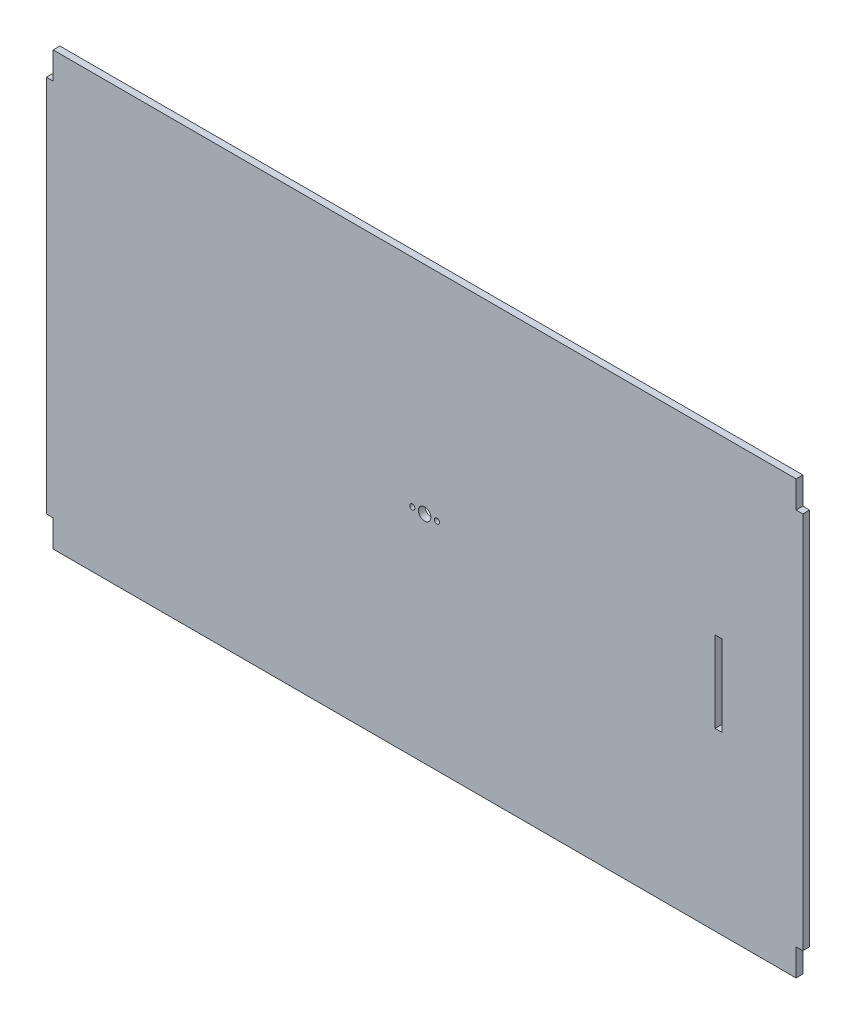
ISO-10303-21;
HEADER;
FILE_DESCRIPTION(('STEP AP214'),'2;1');
FILE_NAME('part.step','',(''),(''),'','','');
FILE_SCHEMA(('AUTOMOTIVE_DESIGN { 1 0 10303 214 1 1 1 1 }'));
ENDSEC;
DATA;
#1=APPLICATION_CONTEXT('core data for automotive mechanical design processes');
#2=APPLICATION_PROTOCOL_DEFINITION('international standard','automotive_design',2000,#1);
#3=PRODUCT_CONTEXT('',#1,'mechanical');
#4=PRODUCT('Part','Part','',(#3));
#5=PRODUCT_RELATED_PRODUCT_CATEGORY('part','',(#4));
#6=PRODUCT_DEFINITION_FORMATION('','',#4);
#7=PRODUCT_DEFINITION_CONTEXT('part definition',#1,'design');
#8=PRODUCT_DEFINITION('design','',#6,#7);
#9=PRODUCT_DEFINITION_SHAPE('','',#8);
#10=(LENGTH_UNIT() NAMED_UNIT(*) SI_UNIT(.MILLI.,.METRE.));
#11=(NAMED_UNIT(*) PLANE_ANGLE_UNIT() SI_UNIT($,.RADIAN.));
#12=(NAMED_UNIT(*) SI_UNIT($,.STERADIAN.) SOLID_ANGLE_UNIT());
#13=UNCERTAINTY_MEASURE_WITH_UNIT(LENGTH_MEASURE(1.E-05),#10,'distance_accuracy_value','');
#14=(GEOMETRIC_REPRESENTATION_CONTEXT(3) GLOBAL_UNCERTAINTY_ASSIGNED_CONTEXT((#13)) GLOBAL_UNIT_ASSIGNED_CONTEXT((#10,
#11,#12)) REPRESENTATION_CONTEXT('',''));
#15=CARTESIAN_POINT('',(0.,0.,0.));
#16=DIRECTION('',(0.,0.,1.));
#17=DIRECTION('',(1.,0.,0.));
#18=AXIS2_PLACEMENT_3D('',#15,#16,#17);
#19=CARTESIAN_POINT('',(3.175,203.2,3.175));
#20=DIRECTION('',(0.,-1.,0.));
#21=DIRECTION('',(0.,0.,-1.));
#22=AXIS2_PLACEMENT_3D('',#19,#20,#21);
#23=PLANE('',#22);
#24=DIRECTION('',(-1.,0.,0.));
#25=VECTOR('',#24,1.);
#26=CARTESIAN_POINT('',(3.175,203.2,0.));
#27=LINE('',#26,#25);
#28=CARTESIAN_POINT('',(352.425,203.2,0.));
#29=VERTEX_POINT('',#28);
#30=CARTESIAN_POINT('',(3.175,203.2,0.));
#31=VERTEX_POINT('',#30);
#32=EDGE_CURVE('E183',#29,#31,#27,.T.);
#33=ORIENTED_EDGE('',*,*,#32,.T.);
#34=DIRECTION('',(0.,0.,-1.));
#35=VECTOR('',#34,1.);
#36=CARTESIAN_POINT('',(3.175,203.2,3.175));
#37=LINE('',#36,#35);
#38=CARTESIAN_POINT('',(3.175,203.2,3.175));
#39=VERTEX_POINT('',#38);
#40=EDGE_CURVE('E11',#39,#31,#37,.T.);
#41=ORIENTED_EDGE('',*,*,#40,.F.);
#42=DIRECTION('',(-1.,0.,0.));
#43=VECTOR('',#42,1.);
#44=CARTESIAN_POINT('',(3.175,203.2,3.175));
#45=LINE('',#44,#43);
#46=CARTESIAN_POINT('',(352.425,203.2,3.175));
#47=VERTEX_POINT('',#46);
#48=EDGE_CURVE('E187',#47,#39,#45,.T.);
#49=ORIENTED_EDGE('',*,*,#48,.F.);
#50=DIRECTION('',(0.,0.,-1.));
#51=VECTOR('',#50,1.);
#52=CARTESIAN_POINT('',(352.425,203.2,3.175));
#53=LINE('',#52,#51);
#54=EDGE_CURVE('E213',#47,#29,#53,.T.);
#55=ORIENTED_EDGE('',*,*,#54,.T.);
#56=EDGE_LOOP('',(#33,#41,#49,#55));
#57=FACE_BOUND('',#56,.T.);
#58=ADVANCED_FACE('F34',(#57),#23,.F.);
#59=CARTESIAN_POINT('',(3.175,203.2,3.175));
#60=DIRECTION('',(1.,0.,0.));
#61=DIRECTION('',(0.,1.,0.));
#62=AXIS2_PLACEMENT_3D('',#59,#60,#61);
#63=PLANE('',#62);
#64=DIRECTION('',(0.,-1.,0.));
#65=VECTOR('',#64,1.);
#66=CARTESIAN_POINT('',(3.175,203.2,0.));
#67=LINE('',#66,#65);
#68=CARTESIAN_POINT('',(3.175,190.5,0.));
#69=VERTEX_POINT('',#68);
#70=EDGE_CURVE('E216',#31,#69,#67,.T.);
#71=ORIENTED_EDGE('',*,*,#70,.T.);
#72=DIRECTION('',(0.,0.,-1.));
#73=VECTOR('',#72,1.);
#74=CARTESIAN_POINT('',(3.175,190.5,3.175));
#75=LINE('',#74,#73);
#76=CARTESIAN_POINT('',(3.175,190.5,3.175));
#77=VERTEX_POINT('',#76);
#78=EDGE_CURVE('E41',#77,#69,#75,.T.);
#79=ORIENTED_EDGE('',*,*,#78,.F.);
#80=DIRECTION('',(0.,-1.,0.));
#81=VECTOR('',#80,1.);
#82=CARTESIAN_POINT('',(3.175,203.2,3.175));
#83=LINE('',#82,#81);
#84=EDGE_CURVE('E190',#39,#77,#83,.T.);
#85=ORIENTED_EDGE('',*,*,#84,.F.);
#86=ORIENTED_EDGE('',*,*,#40,.T.);
#87=EDGE_LOOP('',(#71,#79,#85,#86));
#88=FACE_BOUND('',#87,.T.);
#89=ADVANCED_FACE('F291',(#88),#63,.F.);
#90=CARTESIAN_POINT('',(3.175,190.5,3.175));
#91=DIRECTION('',(0.,-1.,0.));
#92=DIRECTION('',(0.,0.,-1.));
#93=AXIS2_PLACEMENT_3D('',#90,#91,#92);
#94=PLANE('',#93);
#95=DIRECTION('',(-1.,0.,0.));
#96=VECTOR('',#95,1.);
#97=CARTESIAN_POINT('',(3.175,190.5,0.));
#98=LINE('',#97,#96);
#99=CARTESIAN_POINT('',(0.,190.5,0.));
#100=VERTEX_POINT('',#99);
#101=EDGE_CURVE('E218',#69,#100,#98,.T.);
#102=ORIENTED_EDGE('',*,*,#101,.T.);
#103=DIRECTION('',(0.,0.,-1.));
#104=VECTOR('',#103,1.);
#105=CARTESIAN_POINT('',(0.,190.5,3.175));
#106=LINE('',#105,#104);
#107=CARTESIAN_POINT('',(0.,190.5,3.175));
#108=VERTEX_POINT('',#107);
#109=EDGE_CURVE('E263',#108,#100,#106,.T.);
#110=ORIENTED_EDGE('',*,*,#109,.F.);
#111=DIRECTION('',(-1.,0.,0.));
#112=VECTOR('',#111,1.);
#113=CARTESIAN_POINT('',(3.175,190.5,3.175));
#114=LINE('',#113,#112);
#115=EDGE_CURVE('E193',#77,#108,#114,.T.);
#116=ORIENTED_EDGE('',*,*,#115,.F.);
#117=ORIENTED_EDGE('',*,*,#78,.T.);
#118=EDGE_LOOP('',(#102,#110,#116,#117));
#119=FACE_BOUND('',#118,.T.);
#120=ADVANCED_FACE('F270',(#119),#94,.F.);
#121=CARTESIAN_POINT('',(0.,12.7,3.175));
#122=DIRECTION('',(1.,0.,0.));
#123=DIRECTION('',(0.,1.,0.));
#124=AXIS2_PLACEMENT_3D('',#121,#122,#123);
#125=PLANE('',#124);
#126=DIRECTION('',(0.,-1.,0.));
#127=VECTOR('',#126,1.);
#128=CARTESIAN_POINT('',(0.,12.7,0.));
#129=LINE('',#128,#127);
#130=CARTESIAN_POINT('',(0.,12.7,0.));
#131=VERTEX_POINT('',#130);
#132=EDGE_CURVE('E220',#100,#131,#129,.T.);
#133=ORIENTED_EDGE('',*,*,#132,.T.);
#134=DIRECTION('',(0.,0.,-1.));
#135=VECTOR('',#134,1.);
#136=CARTESIAN_POINT('',(0.,12.7,3.175));
#137=LINE('',#136,#135);
#138=CARTESIAN_POINT('',(0.,12.7,3.175));
#139=VERTEX_POINT('',#138);
#140=EDGE_CURVE('E260',#139,#131,#137,.T.);
#141=ORIENTED_EDGE('',*,*,#140,.F.);
#142=DIRECTION('',(0.,-1.,0.));
#143=VECTOR('',#142,1.);
#144=CARTESIAN_POINT('',(0.,12.7,3.175));
#145=LINE('',#144,#143);
#146=EDGE_CURVE('E195',#108,#139,#145,.T.);
#147=ORIENTED_EDGE('',*,*,#146,.F.);
#148=ORIENTED_EDGE('',*,*,#109,.T.);
#149=EDGE_LOOP('',(#133,#141,#147,#148));
#150=FACE_BOUND('',#149,.T.);
#151=ADVANCED_FACE('F279',(#150),#125,.F.);
#152=CARTESIAN_POINT('',(3.17499999999999,12.7,3.175));
#153=DIRECTION('',(0.,1.,0.));
#154=DIRECTION('',(-1.,0.,0.));
#155=AXIS2_PLACEMENT_3D('',#152,#153,#154);
#156=PLANE('',#155);
#157=DIRECTION('',(1.,0.,0.));
#158=VECTOR('',#157,1.);
#159=CARTESIAN_POINT('',(3.17499999999999,12.7,0.));
#160=LINE('',#159,#158);
#161=CARTESIAN_POINT('',(3.17499999999999,12.7,0.));
#162=VERTEX_POINT('',#161);
#163=EDGE_CURVE('E222',#131,#162,#160,.T.);
#164=ORIENTED_EDGE('',*,*,#163,.T.);
#165=DIRECTION('',(0.,0.,-1.));
#166=VECTOR('',#165,1.);
#167=CARTESIAN_POINT('',(3.17499999999999,12.7,3.175));
#168=LINE('',#167,#166);
#169=CARTESIAN_POINT('',(3.17499999999999,12.7,3.175));
#170=VERTEX_POINT('',#169);
#171=EDGE_CURVE('E257',#170,#162,#168,.T.);
#172=ORIENTED_EDGE('',*,*,#171,.F.);
#173=DIRECTION('',(1.,0.,0.));
#174=VECTOR('',#173,1.);
#175=CARTESIAN_POINT('',(3.17499999999999,12.7,3.175));
#176=LINE('',#175,#174);
#177=EDGE_CURVE('E197',#139,#170,#176,.T.);
#178=ORIENTED_EDGE('',*,*,#177,.F.);
#179=ORIENTED_EDGE('',*,*,#140,.T.);
#180=EDGE_LOOP('',(#164,#172,#178,#179));
#181=FACE_BOUND('',#180,.T.);
#182=ADVANCED_FACE('F283',(#181),#156,.F.);
#183=CARTESIAN_POINT('',(3.17499999999999,12.7,3.175));
#184=DIRECTION('',(1.,0.,0.));
#185=DIRECTION('',(0.,1.,0.));
#186=AXIS2_PLACEMENT_3D('',#183,#184,#185);
#187=PLANE('',#186);
#188=DIRECTION('',(0.,-1.,0.));
#189=VECTOR('',#188,1.);
#190=CARTESIAN_POINT('',(3.17499999999999,12.7,0.));
#191=LINE('',#190,#189);
#192=CARTESIAN_POINT('',(3.17499999999998,0.,0.));
#193=VERTEX_POINT('',#192);
#194=EDGE_CURVE('E224',#162,#193,#191,.T.);
#195=ORIENTED_EDGE('',*,*,#194,.T.);
#196=DIRECTION('',(0.,0.,-1.));
#197=VECTOR('',#196,1.);
#198=CARTESIAN_POINT('',(3.17499999999998,0.,3.175));
#199=LINE('',#198,#197);
#200=CARTESIAN_POINT('',(3.17499999999998,0.,3.175));
#201=VERTEX_POINT('',#200);
#202=EDGE_CURVE('E254',#201,#193,#199,.T.);
#203=ORIENTED_EDGE('',*,*,#202,.F.);
#204=DIRECTION('',(0.,-1.,0.));
#205=VECTOR('',#204,1.);
#206=CARTESIAN_POINT('',(3.17499999999999,12.7,3.175));
#207=LINE('',#206,#205);
#208=EDGE_CURVE('E199',#170,#201,#207,.T.);
#209=ORIENTED_EDGE('',*,*,#208,.F.);
#210=ORIENTED_EDGE('',*,*,#171,.T.);
#211=EDGE_LOOP('',(#195,#203,#209,#210));
#212=FACE_BOUND('',#211,.T.);
#213=ADVANCED_FACE('F324',(#212),#187,.F.);
#214=CARTESIAN_POINT('',(3.17499999999998,0.,3.175));
#215=DIRECTION('',(0.,1.,0.));
#216=DIRECTION('',(-1.,0.,0.));
#217=AXIS2_PLACEMENT_3D('',#214,#215,#216);
#218=PLANE('',#217);
#219=DIRECTION('',(1.,0.,0.));
#220=VECTOR('',#219,1.);
#221=CARTESIAN_POINT('',(3.17499999999998,0.,0.));
#222=LINE('',#221,#220);
#223=CARTESIAN_POINT('',(352.425,0.,0.));
#224=VERTEX_POINT('',#223);
#225=EDGE_CURVE('E226',#193,#224,#222,.T.);
#226=ORIENTED_EDGE('',*,*,#225,.T.);
#227=DIRECTION('',(0.,0.,-1.));
#228=VECTOR('',#227,1.);
#229=CARTESIAN_POINT('',(352.425,0.,3.175));
#230=LINE('',#229,#228);
#231=CARTESIAN_POINT('',(352.425,0.,3.175));
#232=VERTEX_POINT('',#231);
#233=EDGE_CURVE('E251',#232,#224,#230,.T.);
#234=ORIENTED_EDGE('',*,*,#233,.F.);
#235=DIRECTION('',(1.,0.,0.));
#236=VECTOR('',#235,1.);
#237=CARTESIAN_POINT('',(3.17499999999998,0.,3.175));
#238=LINE('',#237,#236);
#239=EDGE_CURVE('E201',#201,#232,#238,.T.);
#240=ORIENTED_EDGE('',*,*,#239,.F.);
#241=ORIENTED_EDGE('',*,*,#202,.T.);
#242=EDGE_LOOP('',(#226,#234,#240,#241));
#243=FACE_BOUND('',#242,.T.);
#244=ADVANCED_FACE('F322',(#243),#218,.F.);
#245=CARTESIAN_POINT('',(352.425,0.,3.175));
#246=DIRECTION('',(-1.,0.,0.));
#247=DIRECTION('',(0.,0.,1.));
#248=AXIS2_PLACEMENT_3D('',#245,#246,#247);
#249=PLANE('',#248);
#250=DIRECTION('',(0.,1.,0.));
#251=VECTOR('',#250,1.);
#252=CARTESIAN_POINT('',(352.425,0.,0.));
#253=LINE('',#252,#251);
#254=CARTESIAN_POINT('',(352.425,12.7,0.));
#255=VERTEX_POINT('',#254);
#256=EDGE_CURVE('E228',#224,#255,#253,.T.);
#257=ORIENTED_EDGE('',*,*,#256,.T.);
#258=DIRECTION('',(0.,0.,-1.));
#259=VECTOR('',#258,1.);
#260=CARTESIAN_POINT('',(352.425,12.7,3.175));
#261=LINE('',#260,#259);
#262=CARTESIAN_POINT('',(352.425,12.7,3.175));
#263=VERTEX_POINT('',#262);
#264=EDGE_CURVE('E248',#263,#255,#261,.T.);
#265=ORIENTED_EDGE('',*,*,#264,.F.);
#266=DIRECTION('',(0.,1.,0.));
#267=VECTOR('',#266,1.);
#268=CARTESIAN_POINT('',(352.425,0.,3.175));
#269=LINE('',#268,#267);
#270=EDGE_CURVE('E203',#232,#263,#269,.T.);
#271=ORIENTED_EDGE('',*,*,#270,.F.);
#272=ORIENTED_EDGE('',*,*,#233,.T.);
#273=EDGE_LOOP('',(#257,#265,#271,#272));
#274=FACE_BOUND('',#273,.T.);
#275=ADVANCED_FACE('F318',(#274),#249,.F.);
#276=CARTESIAN_POINT('',(352.425,12.7,3.175));
#277=DIRECTION('',(0.,1.,0.));
#278=DIRECTION('',(0.,0.,1.));
#279=AXIS2_PLACEMENT_3D('',#276,#277,#278);
#280=PLANE('',#279);
#281=DIRECTION('',(1.,0.,0.));
#282=VECTOR('',#281,1.);
#283=CARTESIAN_POINT('',(352.425,12.7,0.));
#284=LINE('',#283,#282);
#285=CARTESIAN_POINT('',(355.6,12.7,0.));
#286=VERTEX_POINT('',#285);
#287=EDGE_CURVE('E230',#255,#286,#284,.T.);
#288=ORIENTED_EDGE('',*,*,#287,.T.);
#289=DIRECTION('',(0.,0.,-1.));
#290=VECTOR('',#289,1.);
#291=CARTESIAN_POINT('',(355.6,12.7,3.175));
#292=LINE('',#291,#290);
#293=CARTESIAN_POINT('',(355.6,12.7,3.175));
#294=VERTEX_POINT('',#293);
#295=EDGE_CURVE('E245',#294,#286,#292,.T.);
#296=ORIENTED_EDGE('',*,*,#295,.F.);
#297=DIRECTION('',(1.,0.,0.));
#298=VECTOR('',#297,1.);
#299=CARTESIAN_POINT('',(352.425,12.7,3.175));
#300=LINE('',#299,#298);
#301=EDGE_CURVE('E205',#263,#294,#300,.T.);
#302=ORIENTED_EDGE('',*,*,#301,.F.);
#303=ORIENTED_EDGE('',*,*,#264,.T.);
#304=EDGE_LOOP('',(#288,#296,#302,#303));
#305=FACE_BOUND('',#304,.T.);
#306=ADVANCED_FACE('F313',(#305),#280,.F.);
#307=CARTESIAN_POINT('',(355.6,12.7,3.175));
#308=DIRECTION('',(-1.,0.,0.));
#309=DIRECTION('',(0.,-1.,0.));
#310=AXIS2_PLACEMENT_3D('',#307,#308,#309);
#311=PLANE('',#310);
#312=DIRECTION('',(0.,1.,0.));
#313=VECTOR('',#312,1.);
#314=CARTESIAN_POINT('',(355.6,12.7,0.));
#315=LINE('',#314,#313);
#316=CARTESIAN_POINT('',(355.6,190.5,0.));
#317=VERTEX_POINT('',#316);
#318=EDGE_CURVE('E232',#286,#317,#315,.T.);
#319=ORIENTED_EDGE('',*,*,#318,.T.);
#320=DIRECTION('',(0.,0.,-1.));
#321=VECTOR('',#320,1.);
#322=CARTESIAN_POINT('',(355.6,190.5,3.175));
#323=LINE('',#322,#321);
#324=CARTESIAN_POINT('',(355.6,190.5,3.175));
#325=VERTEX_POINT('',#324);
#326=EDGE_CURVE('E242',#325,#317,#323,.T.);
#327=ORIENTED_EDGE('',*,*,#326,.F.);
#328=DIRECTION('',(0.,1.,0.));
#329=VECTOR('',#328,1.);
#330=CARTESIAN_POINT('',(355.6,12.7,3.175));
#331=LINE('',#330,#329);
#332=EDGE_CURVE('E207',#294,#325,#331,.T.);
#333=ORIENTED_EDGE('',*,*,#332,.F.);
#334=ORIENTED_EDGE('',*,*,#295,.T.);
#335=EDGE_LOOP('',(#319,#327,#333,#334));
#336=FACE_BOUND('',#335,.T.);
#337=ADVANCED_FACE('F307',(#336),#311,.F.);
#338=CARTESIAN_POINT('',(352.425,190.5,3.175));
#339=DIRECTION('',(0.,-1.,0.));
#340=DIRECTION('',(0.,0.,-1.));
#341=AXIS2_PLACEMENT_3D('',#338,#339,#340);
#342=PLANE('',#341);
#343=DIRECTION('',(-1.,0.,0.));
#344=VECTOR('',#343,1.);
#345=CARTESIAN_POINT('',(352.425,190.5,0.));
#346=LINE('',#345,#344);
#347=CARTESIAN_POINT('',(352.425,190.5,0.));
#348=VERTEX_POINT('',#347);
#349=EDGE_CURVE('E234',#317,#348,#346,.T.);
#350=ORIENTED_EDGE('',*,*,#349,.T.);
#351=DIRECTION('',(0.,0.,-1.));
#352=VECTOR('',#351,1.);
#353=CARTESIAN_POINT('',(352.425,190.5,3.175));
#354=LINE('',#353,#352);
#355=CARTESIAN_POINT('',(352.425,190.5,3.175));
#356=VERTEX_POINT('',#355);
#357=EDGE_CURVE('E239',#356,#348,#354,.T.);
#358=ORIENTED_EDGE('',*,*,#357,.F.);
#359=DIRECTION('',(-1.,0.,0.));
#360=VECTOR('',#359,1.);
#361=CARTESIAN_POINT('',(352.425,190.5,3.175));
#362=LINE('',#361,#360);
#363=EDGE_CURVE('E209',#325,#356,#362,.T.);
#364=ORIENTED_EDGE('',*,*,#363,.F.);
#365=ORIENTED_EDGE('',*,*,#326,.T.);
#366=EDGE_LOOP('',(#350,#358,#364,#365));
#367=FACE_BOUND('',#366,.T.);
#368=ADVANCED_FACE('F303',(#367),#342,.F.);
#369=CARTESIAN_POINT('',(352.425,203.2,3.175));
#370=DIRECTION('',(-1.,0.,0.));
#371=DIRECTION('',(0.,0.,1.));
#372=AXIS2_PLACEMENT_3D('',#369,#370,#371);
#373=PLANE('',#372);
#374=DIRECTION('',(0.,1.,0.));
#375=VECTOR('',#374,1.);
#376=CARTESIAN_POINT('',(352.425,203.2,0.));
#377=LINE('',#376,#375);
#378=EDGE_CURVE('E191',#348,#29,#377,.T.);
#379=ORIENTED_EDGE('',*,*,#378,.T.);
#380=ORIENTED_EDGE('',*,*,#54,.F.);
#381=DIRECTION('',(0.,1.,0.));
#382=VECTOR('',#381,1.);
#383=CARTESIAN_POINT('',(352.425,203.2,3.175));
#384=LINE('',#383,#382);
#385=EDGE_CURVE('E211',#356,#47,#384,.T.);
#386=ORIENTED_EDGE('',*,*,#385,.F.);
#387=ORIENTED_EDGE('',*,*,#357,.T.);
#388=EDGE_LOOP('',(#379,#380,#386,#387));
#389=FACE_BOUND('',#388,.T.);
#390=ADVANCED_FACE('F298',(#389),#373,.F.);
#391=CARTESIAN_POINT('',(0.,0.,3.175));
#392=DIRECTION('',(0.,0.,-1.));
#393=DIRECTION('',(-1.,0.,0.));
#394=AXIS2_PLACEMENT_3D('',#391,#392,#393);
#395=PLANE('',#394);
#396=CARTESIAN_POINT('',(172.0215,101.6,3.175));
#397=DIRECTION('',(0.,0.,1.));
#398=DIRECTION('',(1.,0.,0.));
#399=AXIS2_PLACEMENT_3D('',#396,#397,#398);
#400=CIRCLE('',#399,1.2065);
#401=CARTESIAN_POINT('',(173.228,101.6,3.175));
#402=VERTEX_POINT('',#401);
#403=EDGE_CURVE('E490',#402,#402,#400,.T.);
#404=ORIENTED_EDGE('',*,*,#403,.F.);
#405=EDGE_LOOP('',(#404));
#406=FACE_BOUND('',#405,.T.);
#407=CARTESIAN_POINT('',(183.5785,101.6,3.175));
#408=DIRECTION('',(0.,0.,1.));
#409=DIRECTION('',(1.,0.,0.));
#410=AXIS2_PLACEMENT_3D('',#407,#408,#409);
#411=CIRCLE('',#410,1.2065);
#412=CARTESIAN_POINT('',(184.785,101.6,3.175));
#413=VERTEX_POINT('',#412);
#414=EDGE_CURVE('E492',#413,#413,#411,.T.);
#415=ORIENTED_EDGE('',*,*,#414,.F.);
#416=EDGE_LOOP('',(#415));
#417=FACE_BOUND('',#416,.T.);
#418=CARTESIAN_POINT('',(177.8,101.6,3.175));
#419=DIRECTION('',(0.,0.,1.));
#420=DIRECTION('',(1.,0.,0.));
#421=AXIS2_PLACEMENT_3D('',#418,#419,#420);
#422=CIRCLE('',#421,2.921);
#423=CARTESIAN_POINT('',(180.721,101.6,3.175));
#424=VERTEX_POINT('',#423);
#425=EDGE_CURVE('E170',#424,#424,#422,.T.);
#426=ORIENTED_EDGE('',*,*,#425,.F.);
#427=EDGE_LOOP('',(#426));
#428=FACE_BOUND('',#427,.T.);
#429=DIRECTION('',(-1.,0.,0.));
#430=VECTOR('',#429,1.);
#431=CARTESIAN_POINT('',(317.5,120.65,3.175));
#432=LINE('',#431,#430);
#433=CARTESIAN_POINT('',(317.5,120.65,3.175));
#434=VERTEX_POINT('',#433);
#435=CARTESIAN_POINT('',(314.325,120.65,3.175));
#436=VERTEX_POINT('',#435);
#437=EDGE_CURVE('E176',#434,#436,#432,.T.);
#438=ORIENTED_EDGE('',*,*,#437,.F.);
#439=DIRECTION('',(0.,1.,0.));
#440=VECTOR('',#439,1.);
#441=CARTESIAN_POINT('',(317.5,120.65,3.175));
#442=LINE('',#441,#440);
#443=CARTESIAN_POINT('',(317.5,82.55,3.175));
#444=VERTEX_POINT('',#443);
#445=EDGE_CURVE('E48',#444,#434,#442,.T.);
#446=ORIENTED_EDGE('',*,*,#445,.F.);
#447=DIRECTION('',(1.,0.,0.));
#448=VECTOR('',#447,1.);
#449=CARTESIAN_POINT('',(317.5,82.55,3.175));
#450=LINE('',#449,#448);
#451=CARTESIAN_POINT('',(314.325,82.55,3.175));
#452=VERTEX_POINT('',#451);
#453=EDGE_CURVE('E164',#452,#444,#450,.T.);
#454=ORIENTED_EDGE('',*,*,#453,.F.);
#455=DIRECTION('',(0.,-1.,0.));
#456=VECTOR('',#455,1.);
#457=CARTESIAN_POINT('',(314.325,120.65,3.175));
#458=LINE('',#457,#456);
#459=EDGE_CURVE('E167',#436,#452,#458,.T.);
#460=ORIENTED_EDGE('',*,*,#459,.F.);
#461=EDGE_LOOP('',(#438,#446,#454,#460));
#462=FACE_BOUND('',#461,.T.);
#463=ORIENTED_EDGE('',*,*,#48,.T.);
#464=ORIENTED_EDGE('',*,*,#84,.T.);
#465=ORIENTED_EDGE('',*,*,#115,.T.);
#466=ORIENTED_EDGE('',*,*,#146,.T.);
#467=ORIENTED_EDGE('',*,*,#177,.T.);
#468=ORIENTED_EDGE('',*,*,#208,.T.);
#469=ORIENTED_EDGE('',*,*,#239,.T.);
#470=ORIENTED_EDGE('',*,*,#270,.T.);
#471=ORIENTED_EDGE('',*,*,#301,.T.);
#472=ORIENTED_EDGE('',*,*,#332,.T.);
#473=ORIENTED_EDGE('',*,*,#363,.T.);
#474=ORIENTED_EDGE('',*,*,#385,.T.);
#475=EDGE_LOOP('',(#463,#464,#465,#466,#467,#468,#469,#470,#471,#472,#473,#474));
#476=FACE_BOUND('',#475,.T.);
#477=ADVANCED_FACE('F287',(#406,#417,#428,#462,#476),#395,.F.);
#478=CARTESIAN_POINT('',(0.,0.,0.));
#479=DIRECTION('',(0.,0.,-1.));
#480=DIRECTION('',(-1.,0.,0.));
#481=AXIS2_PLACEMENT_3D('',#478,#479,#480);
#482=PLANE('',#481);
#483=CARTESIAN_POINT('',(172.0215,101.6,0.));
#484=DIRECTION('',(0.,0.,1.));
#485=DIRECTION('',(1.,0.,0.));
#486=AXIS2_PLACEMENT_3D('',#483,#484,#485);
#487=CIRCLE('',#486,1.2065);
#488=CARTESIAN_POINT('',(173.228,101.6,0.));
#489=VERTEX_POINT('',#488);
#490=EDGE_CURVE('E487',#489,#489,#487,.T.);
#491=ORIENTED_EDGE('',*,*,#490,.T.);
#492=EDGE_LOOP('',(#491));
#493=FACE_BOUND('',#492,.T.);
#494=CARTESIAN_POINT('',(183.5785,101.6,0.));
#495=DIRECTION('',(0.,0.,1.));
#496=DIRECTION('',(1.,0.,0.));
#497=AXIS2_PLACEMENT_3D('',#494,#495,#496);
#498=CIRCLE('',#497,1.2065);
#499=CARTESIAN_POINT('',(184.785,101.6,0.));
#500=VERTEX_POINT('',#499);
#501=EDGE_CURVE('E499',#500,#500,#498,.T.);
#502=ORIENTED_EDGE('',*,*,#501,.T.);
#503=EDGE_LOOP('',(#502));
#504=FACE_BOUND('',#503,.T.);
#505=CARTESIAN_POINT('',(177.8,101.6,0.));
#506=DIRECTION('',(0.,0.,1.));
#507=DIRECTION('',(1.,0.,0.));
#508=AXIS2_PLACEMENT_3D('',#505,#506,#507);
#509=CIRCLE('',#508,2.921);
#510=CARTESIAN_POINT('',(180.721,101.6,0.));
#511=VERTEX_POINT('',#510);
#512=EDGE_CURVE('E177',#511,#511,#509,.T.);
#513=ORIENTED_EDGE('',*,*,#512,.T.);
#514=EDGE_LOOP('',(#513));
#515=FACE_BOUND('',#514,.T.);
#516=DIRECTION('',(0.,1.,0.));
#517=VECTOR('',#516,1.);
#518=CARTESIAN_POINT('',(317.5,120.65,0.));
#519=LINE('',#518,#517);
#520=CARTESIAN_POINT('',(317.5,82.55,0.));
#521=VERTEX_POINT('',#520);
#522=CARTESIAN_POINT('',(317.5,120.65,0.));
#523=VERTEX_POINT('',#522);
#524=EDGE_CURVE('E148',#521,#523,#519,.T.);
#525=ORIENTED_EDGE('',*,*,#524,.T.);
#526=DIRECTION('',(-1.,0.,0.));
#527=VECTOR('',#526,1.);
#528=CARTESIAN_POINT('',(317.5,120.65,0.));
#529=LINE('',#528,#527);
#530=CARTESIAN_POINT('',(314.325,120.65,0.));
#531=VERTEX_POINT('',#530);
#532=EDGE_CURVE('E157',#523,#531,#529,.T.);
#533=ORIENTED_EDGE('',*,*,#532,.T.);
#534=DIRECTION('',(0.,-1.,0.));
#535=VECTOR('',#534,1.);
#536=CARTESIAN_POINT('',(314.325,120.65,0.));
#537=LINE('',#536,#535);
#538=CARTESIAN_POINT('',(314.325,82.55,0.));
#539=VERTEX_POINT('',#538);
#540=EDGE_CURVE('E56',#531,#539,#537,.T.);
#541=ORIENTED_EDGE('',*,*,#540,.T.);
#542=DIRECTION('',(1.,0.,0.));
#543=VECTOR('',#542,1.);
#544=CARTESIAN_POINT('',(317.5,82.55,0.));
#545=LINE('',#544,#543);
#546=EDGE_CURVE('E154',#539,#521,#545,.T.);
#547=ORIENTED_EDGE('',*,*,#546,.T.);
#548=EDGE_LOOP('',(#525,#533,#541,#547));
#549=FACE_BOUND('',#548,.T.);
#550=ORIENTED_EDGE('',*,*,#32,.F.);
#551=ORIENTED_EDGE('',*,*,#378,.F.);
#552=ORIENTED_EDGE('',*,*,#349,.F.);
#553=ORIENTED_EDGE('',*,*,#318,.F.);
#554=ORIENTED_EDGE('',*,*,#287,.F.);
#555=ORIENTED_EDGE('',*,*,#256,.F.);
#556=ORIENTED_EDGE('',*,*,#225,.F.);
#557=ORIENTED_EDGE('',*,*,#194,.F.);
#558=ORIENTED_EDGE('',*,*,#163,.F.);
#559=ORIENTED_EDGE('',*,*,#132,.F.);
#560=ORIENTED_EDGE('',*,*,#101,.F.);
#561=ORIENTED_EDGE('',*,*,#70,.F.);
#562=EDGE_LOOP('',(#550,#551,#552,#553,#554,#555,#556,#557,#558,#559,#560,#561));
#563=FACE_BOUND('',#562,.T.);
#564=ADVANCED_FACE('F161',(#493,#504,#515,#549,#563),#482,.T.);
#565=CARTESIAN_POINT('',(317.5,120.65,0.));
#566=DIRECTION('',(1.,0.,0.));
#567=DIRECTION('',(0.,0.,-1.));
#568=AXIS2_PLACEMENT_3D('',#565,#566,#567);
#569=PLANE('',#568);
#570=ORIENTED_EDGE('',*,*,#445,.T.);
#571=DIRECTION('',(0.,0.,1.));
#572=VECTOR('',#571,1.);
#573=CARTESIAN_POINT('',(317.5,120.65,0.));
#574=LINE('',#573,#572);
#575=EDGE_CURVE('E144',#523,#434,#574,.T.);
#576=ORIENTED_EDGE('',*,*,#575,.F.);
#577=ORIENTED_EDGE('',*,*,#524,.F.);
#578=DIRECTION('',(0.,0.,1.));
#579=VECTOR('',#578,1.);
#580=CARTESIAN_POINT('',(317.5,82.55,0.));
#581=LINE('',#580,#579);
#582=EDGE_CURVE('E181',#521,#444,#581,.T.);
#583=ORIENTED_EDGE('',*,*,#582,.T.);
#584=EDGE_LOOP('',(#570,#576,#577,#583));
#585=FACE_BOUND('',#584,.T.);
#586=ADVANCED_FACE('F146',(#585),#569,.F.);
#587=CARTESIAN_POINT('',(317.5,82.55,0.));
#588=DIRECTION('',(0.,-1.,0.));
#589=DIRECTION('',(0.,0.,-1.));
#590=AXIS2_PLACEMENT_3D('',#587,#588,#589);
#591=PLANE('',#590);
#592=ORIENTED_EDGE('',*,*,#453,.T.);
#593=ORIENTED_EDGE('',*,*,#582,.F.);
#594=ORIENTED_EDGE('',*,*,#546,.F.);
#595=DIRECTION('',(0.,0.,1.));
#596=VECTOR('',#595,1.);
#597=CARTESIAN_POINT('',(314.325,82.55,0.));
#598=LINE('',#597,#596);
#599=EDGE_CURVE('E184',#539,#452,#598,.T.);
#600=ORIENTED_EDGE('',*,*,#599,.T.);
#601=EDGE_LOOP('',(#592,#593,#594,#600));
#602=FACE_BOUND('',#601,.T.);
#603=ADVANCED_FACE('F412',(#602),#591,.F.);
#604=CARTESIAN_POINT('',(314.325,120.65,0.));
#605=DIRECTION('',(-1.,0.,0.));
#606=DIRECTION('',(0.,-1.,0.));
#607=AXIS2_PLACEMENT_3D('',#604,#605,#606);
#608=PLANE('',#607);
#609=ORIENTED_EDGE('',*,*,#459,.T.);
#610=ORIENTED_EDGE('',*,*,#599,.F.);
#611=ORIENTED_EDGE('',*,*,#540,.F.);
#612=DIRECTION('',(0.,0.,1.));
#613=VECTOR('',#612,1.);
#614=CARTESIAN_POINT('',(314.325,120.65,0.));
#615=LINE('',#614,#613);
#616=EDGE_CURVE('E153',#531,#436,#615,.T.);
#617=ORIENTED_EDGE('',*,*,#616,.T.);
#618=EDGE_LOOP('',(#609,#610,#611,#617));
#619=FACE_BOUND('',#618,.T.);
#620=ADVANCED_FACE('F423',(#619),#608,.F.);
#621=CARTESIAN_POINT('',(317.5,120.65,0.));
#622=DIRECTION('',(0.,1.,0.));
#623=DIRECTION('',(-1.,0.,0.));
#624=AXIS2_PLACEMENT_3D('',#621,#622,#623);
#625=PLANE('',#624);
#626=ORIENTED_EDGE('',*,*,#437,.T.);
#627=ORIENTED_EDGE('',*,*,#616,.F.);
#628=ORIENTED_EDGE('',*,*,#532,.F.);
#629=ORIENTED_EDGE('',*,*,#575,.T.);
#630=EDGE_LOOP('',(#626,#627,#628,#629));
#631=FACE_BOUND('',#630,.T.);
#632=ADVANCED_FACE('F158',(#631),#625,.F.);
#633=CARTESIAN_POINT('',(177.8,101.6,0.));
#634=DIRECTION('',(0.,0.,1.));
#635=DIRECTION('',(1.,0.,0.));
#636=AXIS2_PLACEMENT_3D('',#633,#634,#635);
#637=CYLINDRICAL_SURFACE('',#636,2.921);
#638=ORIENTED_EDGE('',*,*,#512,.F.);
#639=EDGE_LOOP('',(#638));
#640=FACE_BOUND('',#639,.T.);
#641=ORIENTED_EDGE('',*,*,#425,.T.);
#642=EDGE_LOOP('',(#641));
#643=FACE_BOUND('',#642,.T.);
#644=ADVANCED_FACE('F441',(#640,#643),#637,.F.);
#645=CARTESIAN_POINT('',(183.5785,101.6,0.));
#646=DIRECTION('',(0.,0.,1.));
#647=DIRECTION('',(1.,0.,0.));
#648=AXIS2_PLACEMENT_3D('',#645,#646,#647);
#649=CYLINDRICAL_SURFACE('',#648,1.2065);
#650=ORIENTED_EDGE('',*,*,#501,.F.);
#651=EDGE_LOOP('',(#650));
#652=FACE_BOUND('',#651,.T.);
#653=ORIENTED_EDGE('',*,*,#414,.T.);
#654=EDGE_LOOP('',(#653));
#655=FACE_BOUND('',#654,.T.);
#656=ADVANCED_FACE('F460',(#652,#655),#649,.F.);
#657=CARTESIAN_POINT('',(172.0215,101.6,0.));
#658=DIRECTION('',(0.,0.,1.));
#659=DIRECTION('',(1.,0.,0.));
#660=AXIS2_PLACEMENT_3D('',#657,#658,#659);
#661=CYLINDRICAL_SURFACE('',#660,1.2065);
#662=ORIENTED_EDGE('',*,*,#490,.F.);
#663=EDGE_LOOP('',(#662));
#664=FACE_BOUND('',#663,.T.);
#665=ORIENTED_EDGE('',*,*,#403,.T.);
#666=EDGE_LOOP('',(#665));
#667=FACE_BOUND('',#666,.T.);
#668=ADVANCED_FACE('F470',(#664,#667),#661,.F.);
#669=CLOSED_SHELL('',(#58,#89,#120,#151,#182,#213,#244,#275,#306,#337,#368,#390,#477,#564,#586,
#603,#620,#632,#644,#656,#668));
#670=MANIFOLD_SOLID_BREP('B2',#669);
#671=ADVANCED_BREP_SHAPE_REPRESENTATION('',(#18,#670),#14);
#672=SHAPE_DEFINITION_REPRESENTATION(#9,#671);
ENDSEC;
END-ISO-10303-21;
